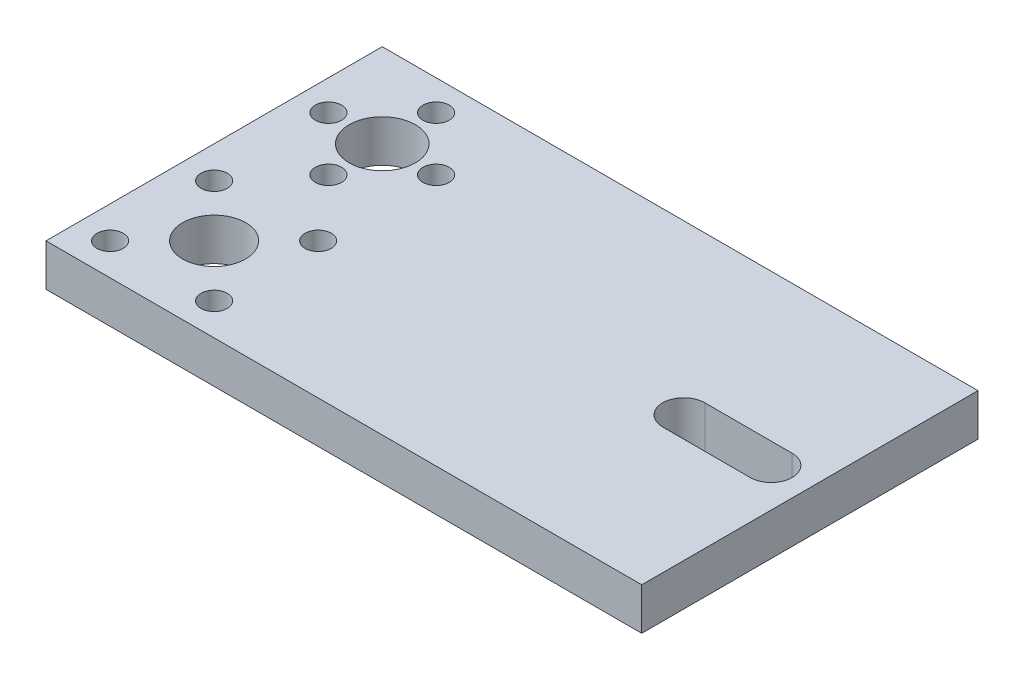
ISO-10303-21;
HEADER;
FILE_DESCRIPTION(('STEP AP214'),'2;1');
FILE_NAME('part.step','',(''),(''),'','','');
FILE_SCHEMA(('AUTOMOTIVE_DESIGN { 1 0 10303 214 1 1 1 1 }'));
ENDSEC;
DATA;
#1=APPLICATION_CONTEXT('core data for automotive mechanical design processes');
#2=APPLICATION_PROTOCOL_DEFINITION('international standard','automotive_design',2000,#1);
#3=PRODUCT_CONTEXT('',#1,'mechanical');
#4=PRODUCT('Part','Part','',(#3));
#5=PRODUCT_RELATED_PRODUCT_CATEGORY('part','',(#4));
#6=PRODUCT_DEFINITION_FORMATION('','',#4);
#7=PRODUCT_DEFINITION_CONTEXT('part definition',#1,'design');
#8=PRODUCT_DEFINITION('design','',#6,#7);
#9=PRODUCT_DEFINITION_SHAPE('','',#8);
#10=(LENGTH_UNIT() NAMED_UNIT(*) SI_UNIT(.MILLI.,.METRE.));
#11=(NAMED_UNIT(*) PLANE_ANGLE_UNIT() SI_UNIT($,.RADIAN.));
#12=(NAMED_UNIT(*) SI_UNIT($,.STERADIAN.) SOLID_ANGLE_UNIT());
#13=UNCERTAINTY_MEASURE_WITH_UNIT(LENGTH_MEASURE(1.E-05),#10,'distance_accuracy_value','');
#14=(GEOMETRIC_REPRESENTATION_CONTEXT(3) GLOBAL_UNCERTAINTY_ASSIGNED_CONTEXT((#13)) GLOBAL_UNIT_ASSIGNED_CONTEXT((#10,
#11,#12)) REPRESENTATION_CONTEXT('',''));
#15=CARTESIAN_POINT('',(0.,0.,0.));
#16=DIRECTION('',(0.,0.,1.));
#17=DIRECTION('',(1.,0.,0.));
#18=AXIS2_PLACEMENT_3D('',#15,#16,#17);
#19=CARTESIAN_POINT('',(0.,6.35,0.));
#20=DIRECTION('',(0.,-1.,0.));
#21=DIRECTION('',(0.,0.,-1.));
#22=AXIS2_PLACEMENT_3D('',#19,#20,#21);
#23=PLANE('',#22);
#24=CARTESIAN_POINT('',(-37.3,6.35,-8.13));
#25=DIRECTION('',(0.,1.,0.));
#26=DIRECTION('',(0.,0.,1.));
#27=AXIS2_PLACEMENT_3D('',#24,#25,#26);
#28=CIRCLE('',#27,1.984375);
#29=CARTESIAN_POINT('',(-37.3,6.35,-6.14562500000001));
#30=VERTEX_POINT('',#29);
#31=EDGE_CURVE('E136',#30,#30,#28,.T.);
#32=ORIENTED_EDGE('',*,*,#31,.F.);
#33=EDGE_LOOP('',(#32));
#34=FACE_BOUND('',#33,.T.);
#35=CARTESIAN_POINT('',(-45.43,6.35,0.));
#36=DIRECTION('',(0.,1.,0.));
#37=DIRECTION('',(0.,0.,1.));
#38=AXIS2_PLACEMENT_3D('',#35,#36,#37);
#39=CIRCLE('',#38,1.984375);
#40=CARTESIAN_POINT('',(-45.43,6.35,1.984375));
#41=VERTEX_POINT('',#40);
#42=EDGE_CURVE('E142',#41,#41,#39,.T.);
#43=ORIENTED_EDGE('',*,*,#42,.F.);
#44=EDGE_LOOP('',(#43));
#45=FACE_BOUND('',#44,.T.);
#46=CARTESIAN_POINT('',(-37.3,6.35,25.4));
#47=DIRECTION('',(0.,1.,0.));
#48=DIRECTION('',(0.,0.,-1.));
#49=AXIS2_PLACEMENT_3D('',#46,#47,#48);
#50=CIRCLE('',#49,4.7625);
#51=CARTESIAN_POINT('',(-37.3,6.35,20.6375));
#52=VERTEX_POINT('',#51);
#53=EDGE_CURVE('E148',#52,#52,#50,.T.);
#54=ORIENTED_EDGE('',*,*,#53,.F.);
#55=EDGE_LOOP('',(#54));
#56=FACE_BOUND('',#55,.T.);
#57=CARTESIAN_POINT('',(-37.3,6.35,8.13));
#58=DIRECTION('',(0.,1.,0.));
#59=DIRECTION('',(0.,0.,1.));
#60=AXIS2_PLACEMENT_3D('',#57,#58,#59);
#61=CIRCLE('',#60,1.984375);
#62=CARTESIAN_POINT('',(-37.3,6.35,10.114375));
#63=VERTEX_POINT('',#62);
#64=EDGE_CURVE('E154',#63,#63,#61,.T.);
#65=ORIENTED_EDGE('',*,*,#64,.F.);
#66=EDGE_LOOP('',(#65));
#67=FACE_BOUND('',#66,.T.);
#68=CARTESIAN_POINT('',(-37.3,6.35,0.));
#69=DIRECTION('',(0.,1.,0.));
#70=DIRECTION('',(0.,0.,1.));
#71=AXIS2_PLACEMENT_3D('',#68,#69,#70);
#72=CIRCLE('',#71,5.);
#73=CARTESIAN_POINT('',(-37.3,6.35,5.));
#74=VERTEX_POINT('',#73);
#75=EDGE_CURVE('E160',#74,#74,#72,.T.);
#76=ORIENTED_EDGE('',*,*,#75,.F.);
#77=EDGE_LOOP('',(#76));
#78=FACE_BOUND('',#77,.T.);
#79=DIRECTION('',(0.,0.,1.));
#80=VECTOR('',#79,1.);
#81=CARTESIAN_POINT('',(-50.,6.35,38.1));
#82=LINE('',#81,#80);
#83=CARTESIAN_POINT('',(-50.,6.35,-12.7));
#84=VERTEX_POINT('',#83);
#85=CARTESIAN_POINT('',(-50.,6.35,38.1));
#86=VERTEX_POINT('',#85);
#87=EDGE_CURVE('E166',#84,#86,#82,.T.);
#88=ORIENTED_EDGE('',*,*,#87,.T.);
#89=DIRECTION('',(1.,0.,0.));
#90=VECTOR('',#89,1.);
#91=CARTESIAN_POINT('',(-50.,6.35,38.1));
#92=LINE('',#91,#90);
#93=CARTESIAN_POINT('',(40.,6.35,38.1));
#94=VERTEX_POINT('',#93);
#95=EDGE_CURVE('E169',#86,#94,#92,.T.);
#96=ORIENTED_EDGE('',*,*,#95,.T.);
#97=DIRECTION('',(0.,0.,-1.));
#98=VECTOR('',#97,1.);
#99=CARTESIAN_POINT('',(40.,6.35,38.1));
#100=LINE('',#99,#98);
#101=CARTESIAN_POINT('',(40.,6.35,-12.7));
#102=VERTEX_POINT('',#101);
#103=EDGE_CURVE('E172',#94,#102,#100,.T.);
#104=ORIENTED_EDGE('',*,*,#103,.T.);
#105=DIRECTION('',(-1.,0.,0.));
#106=VECTOR('',#105,1.);
#107=CARTESIAN_POINT('',(-50.,6.35,-12.7));
#108=LINE('',#107,#106);
#109=EDGE_CURVE('E174',#102,#84,#108,.T.);
#110=ORIENTED_EDGE('',*,*,#109,.T.);
#111=EDGE_LOOP('',(#88,#96,#104,#110));
#112=FACE_BOUND('',#111,.T.);
#113=CARTESIAN_POINT('',(20.945,6.35,12.7));
#114=DIRECTION('',(0.,1.,0.));
#115=DIRECTION('',(0.,0.,1.));
#116=AXIS2_PLACEMENT_3D('',#113,#114,#115);
#117=CIRCLE('',#116,3.175);
#118=CARTESIAN_POINT('',(20.945,6.35,9.525));
#119=VERTEX_POINT('',#118);
#120=CARTESIAN_POINT('',(20.945,6.35,15.875));
#121=VERTEX_POINT('',#120);
#122=EDGE_CURVE('E97',#119,#121,#117,.T.);
#123=ORIENTED_EDGE('',*,*,#122,.F.);
#124=DIRECTION('',(-1.,0.,0.));
#125=VECTOR('',#124,1.);
#126=CARTESIAN_POINT('',(20.945,6.35,9.525));
#127=LINE('',#126,#125);
#128=CARTESIAN_POINT('',(34.155,6.35,9.52499999999999));
#129=VERTEX_POINT('',#128);
#130=EDGE_CURVE('E120',#129,#119,#127,.T.);
#131=ORIENTED_EDGE('',*,*,#130,.F.);
#132=CARTESIAN_POINT('',(34.155,6.35,12.7));
#133=DIRECTION('',(0.,1.,0.));
#134=DIRECTION('',(0.,0.,1.));
#135=AXIS2_PLACEMENT_3D('',#132,#133,#134);
#136=CIRCLE('',#135,3.175);
#137=CARTESIAN_POINT('',(34.155,6.35,15.875));
#138=VERTEX_POINT('',#137);
#139=EDGE_CURVE('E118',#138,#129,#136,.T.);
#140=ORIENTED_EDGE('',*,*,#139,.F.);
#141=DIRECTION('',(1.,0.,0.));
#142=VECTOR('',#141,1.);
#143=CARTESIAN_POINT('',(20.945,6.35,15.875));
#144=LINE('',#143,#142);
#145=EDGE_CURVE('E105',#121,#138,#144,.T.);
#146=ORIENTED_EDGE('',*,*,#145,.F.);
#147=EDGE_LOOP('',(#123,#131,#140,#146));
#148=FACE_BOUND('',#147,.T.);
#149=CARTESIAN_POINT('',(-29.17,6.35,0.));
#150=DIRECTION('',(0.,1.,0.));
#151=DIRECTION('',(0.,0.,1.));
#152=AXIS2_PLACEMENT_3D('',#149,#150,#151);
#153=CIRCLE('',#152,1.984375);
#154=CARTESIAN_POINT('',(-29.17,6.35,1.98437499999999));
#155=VERTEX_POINT('',#154);
#156=EDGE_CURVE('E126',#155,#155,#153,.T.);
#157=ORIENTED_EDGE('',*,*,#156,.F.);
#158=EDGE_LOOP('',(#157));
#159=FACE_BOUND('',#158,.T.);
#160=CARTESIAN_POINT('',(-45.1577241059355,6.35,17.5422758940645));
#161=DIRECTION('',(0.,1.,0.));
#162=DIRECTION('',(0.,0.,1.));
#163=AXIS2_PLACEMENT_3D('',#160,#161,#162);
#164=CIRCLE('',#163,1.98437499999999);
#165=CARTESIAN_POINT('',(-45.1577241059355,6.35,19.5266508940645));
#166=VERTEX_POINT('',#165);
#167=EDGE_CURVE('E317',#166,#166,#164,.T.);
#168=ORIENTED_EDGE('',*,*,#167,.F.);
#169=EDGE_LOOP('',(#168));
#170=FACE_BOUND('',#169,.T.);
#171=CARTESIAN_POINT('',(-29.4422758940645,6.35,17.5422758940644));
#172=DIRECTION('',(0.,1.,0.));
#173=DIRECTION('',(0.,0.,1.));
#174=AXIS2_PLACEMENT_3D('',#171,#172,#173);
#175=CIRCLE('',#174,1.98437499999999);
#176=CARTESIAN_POINT('',(-29.4422758940645,6.35,19.5266508940643));
#177=VERTEX_POINT('',#176);
#178=EDGE_CURVE('E311',#177,#177,#175,.T.);
#179=ORIENTED_EDGE('',*,*,#178,.F.);
#180=EDGE_LOOP('',(#179));
#181=FACE_BOUND('',#180,.T.);
#182=CARTESIAN_POINT('',(-29.4422758940644,6.35,33.2577241059354));
#183=DIRECTION('',(0.,1.,0.));
#184=DIRECTION('',(0.,0.,1.));
#185=AXIS2_PLACEMENT_3D('',#182,#183,#184);
#186=CIRCLE('',#185,1.984375);
#187=CARTESIAN_POINT('',(-29.4422758940644,6.35,35.2420991059354));
#188=VERTEX_POINT('',#187);
#189=EDGE_CURVE('E305',#188,#188,#186,.T.);
#190=ORIENTED_EDGE('',*,*,#189,.F.);
#191=EDGE_LOOP('',(#190));
#192=FACE_BOUND('',#191,.T.);
#193=CARTESIAN_POINT('',(-45.1577241059354,6.35,33.2577241059355));
#194=DIRECTION('',(0.,1.,0.));
#195=DIRECTION('',(0.,0.,1.));
#196=AXIS2_PLACEMENT_3D('',#193,#194,#195);
#197=CIRCLE('',#196,1.98437499999999);
#198=CARTESIAN_POINT('',(-45.1577241059354,6.35,35.2420991059355));
#199=VERTEX_POINT('',#198);
#200=EDGE_CURVE('E296',#199,#199,#197,.T.);
#201=ORIENTED_EDGE('',*,*,#200,.F.);
#202=EDGE_LOOP('',(#201));
#203=FACE_BOUND('',#202,.T.);
#204=ADVANCED_FACE('F32',(#34,#45,#56,#67,#78,#112,#148,#159,#170,#181,#192,#203),#23,.F.);
#205=CARTESIAN_POINT('',(0.,0.,0.));
#206=DIRECTION('',(0.,-1.,0.));
#207=DIRECTION('',(0.,0.,-1.));
#208=AXIS2_PLACEMENT_3D('',#205,#206,#207);
#209=PLANE('',#208);
#210=CARTESIAN_POINT('',(-29.4422758940644,0.,33.2577241059354));
#211=DIRECTION('',(0.,1.,0.));
#212=DIRECTION('',(0.,0.,1.));
#213=AXIS2_PLACEMENT_3D('',#210,#211,#212);
#214=CIRCLE('',#213,1.984375);
#215=CARTESIAN_POINT('',(-29.4422758940644,0.,35.2420991059354));
#216=VERTEX_POINT('',#215);
#217=EDGE_CURVE('E302',#216,#216,#214,.T.);
#218=ORIENTED_EDGE('',*,*,#217,.T.);
#219=EDGE_LOOP('',(#218));
#220=FACE_BOUND('',#219,.T.);
#221=CARTESIAN_POINT('',(-45.1577241059355,0.,17.5422758940645));
#222=DIRECTION('',(0.,1.,0.));
#223=DIRECTION('',(0.,0.,1.));
#224=AXIS2_PLACEMENT_3D('',#221,#222,#223);
#225=CIRCLE('',#224,1.98437499999999);
#226=CARTESIAN_POINT('',(-45.1577241059355,0.,19.5266508940645));
#227=VERTEX_POINT('',#226);
#228=EDGE_CURVE('E314',#227,#227,#225,.T.);
#229=ORIENTED_EDGE('',*,*,#228,.T.);
#230=EDGE_LOOP('',(#229));
#231=FACE_BOUND('',#230,.T.);
#232=DIRECTION('',(-1.,0.,0.));
#233=VECTOR('',#232,1.);
#234=CARTESIAN_POINT('',(20.945,0.,9.525));
#235=LINE('',#234,#233);
#236=CARTESIAN_POINT('',(34.155,0.,9.52499999999999));
#237=VERTEX_POINT('',#236);
#238=CARTESIAN_POINT('',(20.945,0.,9.525));
#239=VERTEX_POINT('',#238);
#240=EDGE_CURVE('E106',#237,#239,#235,.T.);
#241=ORIENTED_EDGE('',*,*,#240,.T.);
#242=CARTESIAN_POINT('',(20.945,0.,12.7));
#243=DIRECTION('',(0.,1.,0.));
#244=DIRECTION('',(0.,0.,1.));
#245=AXIS2_PLACEMENT_3D('',#242,#243,#244);
#246=CIRCLE('',#245,3.175);
#247=CARTESIAN_POINT('',(20.945,0.,15.875));
#248=VERTEX_POINT('',#247);
#249=EDGE_CURVE('E55',#239,#248,#246,.T.);
#250=ORIENTED_EDGE('',*,*,#249,.T.);
#251=DIRECTION('',(1.,0.,0.));
#252=VECTOR('',#251,1.);
#253=CARTESIAN_POINT('',(20.945,0.,15.875));
#254=LINE('',#253,#252);
#255=CARTESIAN_POINT('',(34.155,0.,15.875));
#256=VERTEX_POINT('',#255);
#257=EDGE_CURVE('E112',#248,#256,#254,.T.);
#258=ORIENTED_EDGE('',*,*,#257,.T.);
#259=CARTESIAN_POINT('',(34.155,0.,12.7));
#260=DIRECTION('',(0.,1.,0.));
#261=DIRECTION('',(0.,0.,1.));
#262=AXIS2_PLACEMENT_3D('',#259,#260,#261);
#263=CIRCLE('',#262,3.175);
#264=EDGE_CURVE('E128',#256,#237,#263,.T.);
#265=ORIENTED_EDGE('',*,*,#264,.T.);
#266=EDGE_LOOP('',(#241,#250,#258,#265));
#267=FACE_BOUND('',#266,.T.);
#268=CARTESIAN_POINT('',(-37.3,0.,-8.13));
#269=DIRECTION('',(0.,1.,0.));
#270=DIRECTION('',(0.,0.,1.));
#271=AXIS2_PLACEMENT_3D('',#268,#269,#270);
#272=CIRCLE('',#271,1.984375);
#273=CARTESIAN_POINT('',(-37.3,0.,-6.14562500000001));
#274=VERTEX_POINT('',#273);
#275=EDGE_CURVE('E113',#274,#274,#272,.T.);
#276=ORIENTED_EDGE('',*,*,#275,.T.);
#277=EDGE_LOOP('',(#276));
#278=FACE_BOUND('',#277,.T.);
#279=CARTESIAN_POINT('',(-37.3,0.,25.4));
#280=DIRECTION('',(0.,1.,0.));
#281=DIRECTION('',(0.,0.,-1.));
#282=AXIS2_PLACEMENT_3D('',#279,#280,#281);
#283=CIRCLE('',#282,4.7625);
#284=CARTESIAN_POINT('',(-37.3,0.,20.6375));
#285=VERTEX_POINT('',#284);
#286=EDGE_CURVE('E145',#285,#285,#283,.T.);
#287=ORIENTED_EDGE('',*,*,#286,.T.);
#288=EDGE_LOOP('',(#287));
#289=FACE_BOUND('',#288,.T.);
#290=CARTESIAN_POINT('',(-37.3,0.,0.));
#291=DIRECTION('',(0.,1.,0.));
#292=DIRECTION('',(0.,0.,1.));
#293=AXIS2_PLACEMENT_3D('',#290,#291,#292);
#294=CIRCLE('',#293,5.);
#295=CARTESIAN_POINT('',(-37.3,0.,5.));
#296=VERTEX_POINT('',#295);
#297=EDGE_CURVE('E157',#296,#296,#294,.T.);
#298=ORIENTED_EDGE('',*,*,#297,.T.);
#299=EDGE_LOOP('',(#298));
#300=FACE_BOUND('',#299,.T.);
#301=DIRECTION('',(0.,0.,1.));
#302=VECTOR('',#301,1.);
#303=CARTESIAN_POINT('',(-50.,0.,38.1));
#304=LINE('',#303,#302);
#305=CARTESIAN_POINT('',(-50.,0.,-12.7));
#306=VERTEX_POINT('',#305);
#307=CARTESIAN_POINT('',(-50.,0.,38.1));
#308=VERTEX_POINT('',#307);
#309=EDGE_CURVE('E163',#306,#308,#304,.T.);
#310=ORIENTED_EDGE('',*,*,#309,.F.);
#311=DIRECTION('',(-1.,0.,0.));
#312=VECTOR('',#311,1.);
#313=CARTESIAN_POINT('',(-50.,0.,-12.7));
#314=LINE('',#313,#312);
#315=CARTESIAN_POINT('',(40.,0.,-12.7));
#316=VERTEX_POINT('',#315);
#317=EDGE_CURVE('E170',#316,#306,#314,.T.);
#318=ORIENTED_EDGE('',*,*,#317,.F.);
#319=DIRECTION('',(0.,0.,-1.));
#320=VECTOR('',#319,1.);
#321=CARTESIAN_POINT('',(40.,0.,38.1));
#322=LINE('',#321,#320);
#323=CARTESIAN_POINT('',(40.,0.,38.1));
#324=VERTEX_POINT('',#323);
#325=EDGE_CURVE('E181',#324,#316,#322,.T.);
#326=ORIENTED_EDGE('',*,*,#325,.F.);
#327=DIRECTION('',(1.,0.,0.));
#328=VECTOR('',#327,1.);
#329=CARTESIAN_POINT('',(-50.,0.,38.1));
#330=LINE('',#329,#328);
#331=EDGE_CURVE('E179',#308,#324,#330,.T.);
#332=ORIENTED_EDGE('',*,*,#331,.F.);
#333=EDGE_LOOP('',(#310,#318,#326,#332));
#334=FACE_BOUND('',#333,.T.);
#335=CARTESIAN_POINT('',(-37.3,0.,8.13));
#336=DIRECTION('',(0.,1.,0.));
#337=DIRECTION('',(0.,0.,1.));
#338=AXIS2_PLACEMENT_3D('',#335,#336,#337);
#339=CIRCLE('',#338,1.984375);
#340=CARTESIAN_POINT('',(-37.3,0.,10.114375));
#341=VERTEX_POINT('',#340);
#342=EDGE_CURVE('E151',#341,#341,#339,.T.);
#343=ORIENTED_EDGE('',*,*,#342,.T.);
#344=EDGE_LOOP('',(#343));
#345=FACE_BOUND('',#344,.T.);
#346=CARTESIAN_POINT('',(-45.43,0.,0.));
#347=DIRECTION('',(0.,1.,0.));
#348=DIRECTION('',(0.,0.,1.));
#349=AXIS2_PLACEMENT_3D('',#346,#347,#348);
#350=CIRCLE('',#349,1.984375);
#351=CARTESIAN_POINT('',(-45.43,0.,1.984375));
#352=VERTEX_POINT('',#351);
#353=EDGE_CURVE('E139',#352,#352,#350,.T.);
#354=ORIENTED_EDGE('',*,*,#353,.T.);
#355=EDGE_LOOP('',(#354));
#356=FACE_BOUND('',#355,.T.);
#357=CARTESIAN_POINT('',(-29.17,0.,0.));
#358=DIRECTION('',(0.,1.,0.));
#359=DIRECTION('',(0.,0.,1.));
#360=AXIS2_PLACEMENT_3D('',#357,#358,#359);
#361=CIRCLE('',#360,1.984375);
#362=CARTESIAN_POINT('',(-29.17,0.,1.98437499999999));
#363=VERTEX_POINT('',#362);
#364=EDGE_CURVE('E320',#363,#363,#361,.T.);
#365=ORIENTED_EDGE('',*,*,#364,.T.);
#366=EDGE_LOOP('',(#365));
#367=FACE_BOUND('',#366,.T.);
#368=CARTESIAN_POINT('',(-29.4422758940645,0.,17.5422758940644));
#369=DIRECTION('',(0.,1.,0.));
#370=DIRECTION('',(0.,0.,1.));
#371=AXIS2_PLACEMENT_3D('',#368,#369,#370);
#372=CIRCLE('',#371,1.98437499999999);
#373=CARTESIAN_POINT('',(-29.4422758940645,0.,19.5266508940643));
#374=VERTEX_POINT('',#373);
#375=EDGE_CURVE('E308',#374,#374,#372,.T.);
#376=ORIENTED_EDGE('',*,*,#375,.T.);
#377=EDGE_LOOP('',(#376));
#378=FACE_BOUND('',#377,.T.);
#379=CARTESIAN_POINT('',(-45.1577241059354,0.,33.2577241059355));
#380=DIRECTION('',(0.,1.,0.));
#381=DIRECTION('',(0.,0.,1.));
#382=AXIS2_PLACEMENT_3D('',#379,#380,#381);
#383=CIRCLE('',#382,1.98437499999999);
#384=CARTESIAN_POINT('',(-45.1577241059354,0.,35.2420991059355));
#385=VERTEX_POINT('',#384);
#386=EDGE_CURVE('E299',#385,#385,#383,.T.);
#387=ORIENTED_EDGE('',*,*,#386,.T.);
#388=EDGE_LOOP('',(#387));
#389=FACE_BOUND('',#388,.T.);
#390=ADVANCED_FACE('F199',(#220,#231,#267,#278,#289,#300,#334,#345,#356,#367,#378,#389),#209,.T.);
#391=CARTESIAN_POINT('',(-50.,6.35,38.1));
#392=DIRECTION('',(1.,0.,0.));
#393=DIRECTION('',(0.,0.,-1.));
#394=AXIS2_PLACEMENT_3D('',#391,#392,#393);
#395=PLANE('',#394);
#396=ORIENTED_EDGE('',*,*,#309,.T.);
#397=DIRECTION('',(0.,-1.,0.));
#398=VECTOR('',#397,1.);
#399=CARTESIAN_POINT('',(-50.,6.35,38.1));
#400=LINE('',#399,#398);
#401=EDGE_CURVE('E11',#86,#308,#400,.T.);
#402=ORIENTED_EDGE('',*,*,#401,.F.);
#403=ORIENTED_EDGE('',*,*,#87,.F.);
#404=DIRECTION('',(0.,-1.,0.));
#405=VECTOR('',#404,1.);
#406=CARTESIAN_POINT('',(-50.,6.35,-12.7));
#407=LINE('',#406,#405);
#408=EDGE_CURVE('E176',#84,#306,#407,.T.);
#409=ORIENTED_EDGE('',*,*,#408,.T.);
#410=EDGE_LOOP('',(#396,#402,#403,#409));
#411=FACE_BOUND('',#410,.T.);
#412=ADVANCED_FACE('F34',(#411),#395,.F.);
#413=CARTESIAN_POINT('',(-50.,6.35,38.1));
#414=DIRECTION('',(0.,0.,-1.));
#415=DIRECTION('',(-1.,0.,0.));
#416=AXIS2_PLACEMENT_3D('',#413,#414,#415);
#417=PLANE('',#416);
#418=ORIENTED_EDGE('',*,*,#331,.T.);
#419=DIRECTION('',(0.,-1.,0.));
#420=VECTOR('',#419,1.);
#421=CARTESIAN_POINT('',(40.,6.35,38.1));
#422=LINE('',#421,#420);
#423=EDGE_CURVE('E40',#94,#324,#422,.T.);
#424=ORIENTED_EDGE('',*,*,#423,.F.);
#425=ORIENTED_EDGE('',*,*,#95,.F.);
#426=ORIENTED_EDGE('',*,*,#401,.T.);
#427=EDGE_LOOP('',(#418,#424,#425,#426));
#428=FACE_BOUND('',#427,.T.);
#429=ADVANCED_FACE('F209',(#428),#417,.F.);
#430=CARTESIAN_POINT('',(40.,6.35,38.1));
#431=DIRECTION('',(-1.,0.,0.));
#432=DIRECTION('',(0.,0.,1.));
#433=AXIS2_PLACEMENT_3D('',#430,#431,#432);
#434=PLANE('',#433);
#435=ORIENTED_EDGE('',*,*,#325,.T.);
#436=DIRECTION('',(0.,-1.,0.));
#437=VECTOR('',#436,1.);
#438=CARTESIAN_POINT('',(40.,6.35,-12.7));
#439=LINE('',#438,#437);
#440=EDGE_CURVE('E186',#102,#316,#439,.T.);
#441=ORIENTED_EDGE('',*,*,#440,.F.);
#442=ORIENTED_EDGE('',*,*,#103,.F.);
#443=ORIENTED_EDGE('',*,*,#423,.T.);
#444=EDGE_LOOP('',(#435,#441,#442,#443));
#445=FACE_BOUND('',#444,.T.);
#446=ADVANCED_FACE('F193',(#445),#434,.F.);
#447=CARTESIAN_POINT('',(-50.,6.35,-12.7));
#448=DIRECTION('',(0.,0.,1.));
#449=DIRECTION('',(1.,0.,0.));
#450=AXIS2_PLACEMENT_3D('',#447,#448,#449);
#451=PLANE('',#450);
#452=ORIENTED_EDGE('',*,*,#317,.T.);
#453=ORIENTED_EDGE('',*,*,#408,.F.);
#454=ORIENTED_EDGE('',*,*,#109,.F.);
#455=ORIENTED_EDGE('',*,*,#440,.T.);
#456=EDGE_LOOP('',(#452,#453,#454,#455));
#457=FACE_BOUND('',#456,.T.);
#458=ADVANCED_FACE('F203',(#457),#451,.F.);
#459=CARTESIAN_POINT('',(-37.3,6.35,0.));
#460=DIRECTION('',(0.,-1.,0.));
#461=DIRECTION('',(0.,0.,-1.));
#462=AXIS2_PLACEMENT_3D('',#459,#460,#461);
#463=CYLINDRICAL_SURFACE('',#462,5.);
#464=ORIENTED_EDGE('',*,*,#75,.T.);
#465=EDGE_LOOP('',(#464));
#466=FACE_BOUND('',#465,.T.);
#467=ORIENTED_EDGE('',*,*,#297,.F.);
#468=EDGE_LOOP('',(#467));
#469=FACE_BOUND('',#468,.T.);
#470=ADVANCED_FACE('F227',(#466,#469),#463,.F.);
#471=CARTESIAN_POINT('',(-37.3,6.35,8.13));
#472=DIRECTION('',(0.,-1.,0.));
#473=DIRECTION('',(0.,0.,-1.));
#474=AXIS2_PLACEMENT_3D('',#471,#472,#473);
#475=CYLINDRICAL_SURFACE('',#474,1.984375);
#476=ORIENTED_EDGE('',*,*,#64,.T.);
#477=EDGE_LOOP('',(#476));
#478=FACE_BOUND('',#477,.T.);
#479=ORIENTED_EDGE('',*,*,#342,.F.);
#480=EDGE_LOOP('',(#479));
#481=FACE_BOUND('',#480,.T.);
#482=ADVANCED_FACE('F234',(#478,#481),#475,.F.);
#483=CARTESIAN_POINT('',(-37.3,6.35,25.4));
#484=DIRECTION('',(0.,-1.,0.));
#485=DIRECTION('',(0.,0.,-1.));
#486=AXIS2_PLACEMENT_3D('',#483,#484,#485);
#487=CYLINDRICAL_SURFACE('',#486,4.7625);
#488=ORIENTED_EDGE('',*,*,#53,.T.);
#489=EDGE_LOOP('',(#488));
#490=FACE_BOUND('',#489,.T.);
#491=ORIENTED_EDGE('',*,*,#286,.F.);
#492=EDGE_LOOP('',(#491));
#493=FACE_BOUND('',#492,.T.);
#494=ADVANCED_FACE('F239',(#490,#493),#487,.F.);
#495=CARTESIAN_POINT('',(-45.43,6.35,0.));
#496=DIRECTION('',(0.,-1.,0.));
#497=DIRECTION('',(0.,0.,-1.));
#498=AXIS2_PLACEMENT_3D('',#495,#496,#497);
#499=CYLINDRICAL_SURFACE('',#498,1.984375);
#500=ORIENTED_EDGE('',*,*,#42,.T.);
#501=EDGE_LOOP('',(#500));
#502=FACE_BOUND('',#501,.T.);
#503=ORIENTED_EDGE('',*,*,#353,.F.);
#504=EDGE_LOOP('',(#503));
#505=FACE_BOUND('',#504,.T.);
#506=ADVANCED_FACE('F249',(#502,#505),#499,.F.);
#507=CARTESIAN_POINT('',(-37.3,6.35,-8.13));
#508=DIRECTION('',(0.,-1.,0.));
#509=DIRECTION('',(0.,0.,-1.));
#510=AXIS2_PLACEMENT_3D('',#507,#508,#509);
#511=CYLINDRICAL_SURFACE('',#510,1.984375);
#512=ORIENTED_EDGE('',*,*,#31,.T.);
#513=EDGE_LOOP('',(#512));
#514=FACE_BOUND('',#513,.T.);
#515=ORIENTED_EDGE('',*,*,#275,.F.);
#516=EDGE_LOOP('',(#515));
#517=FACE_BOUND('',#516,.T.);
#518=ADVANCED_FACE('F256',(#514,#517),#511,.F.);
#519=CARTESIAN_POINT('',(20.945,6.35,12.7));
#520=DIRECTION('',(0.,-1.,0.));
#521=DIRECTION('',(0.,0.,-1.));
#522=AXIS2_PLACEMENT_3D('',#519,#520,#521);
#523=CYLINDRICAL_SURFACE('',#522,3.175);
#524=ORIENTED_EDGE('',*,*,#249,.F.);
#525=DIRECTION('',(0.,-1.,0.));
#526=VECTOR('',#525,1.);
#527=CARTESIAN_POINT('',(20.945,6.35,9.525));
#528=LINE('',#527,#526);
#529=EDGE_CURVE('E101',#119,#239,#528,.T.);
#530=ORIENTED_EDGE('',*,*,#529,.F.);
#531=ORIENTED_EDGE('',*,*,#122,.T.);
#532=DIRECTION('',(0.,-1.,0.));
#533=VECTOR('',#532,1.);
#534=CARTESIAN_POINT('',(20.945,6.35,15.875));
#535=LINE('',#534,#533);
#536=EDGE_CURVE('E100',#121,#248,#535,.T.);
#537=ORIENTED_EDGE('',*,*,#536,.T.);
#538=EDGE_LOOP('',(#524,#530,#531,#537));
#539=FACE_BOUND('',#538,.T.);
#540=ADVANCED_FACE('F99',(#539),#523,.F.);
#541=CARTESIAN_POINT('',(20.945,6.35,15.875));
#542=DIRECTION('',(0.,0.,-1.));
#543=DIRECTION('',(-1.,0.,0.));
#544=AXIS2_PLACEMENT_3D('',#541,#542,#543);
#545=PLANE('',#544);
#546=ORIENTED_EDGE('',*,*,#257,.F.);
#547=ORIENTED_EDGE('',*,*,#536,.F.);
#548=ORIENTED_EDGE('',*,*,#145,.T.);
#549=DIRECTION('',(0.,-1.,0.));
#550=VECTOR('',#549,1.);
#551=CARTESIAN_POINT('',(34.155,6.35,15.875));
#552=LINE('',#551,#550);
#553=EDGE_CURVE('E114',#138,#256,#552,.T.);
#554=ORIENTED_EDGE('',*,*,#553,.T.);
#555=EDGE_LOOP('',(#546,#547,#548,#554));
#556=FACE_BOUND('',#555,.T.);
#557=ADVANCED_FACE('F109',(#556),#545,.T.);
#558=CARTESIAN_POINT('',(34.155,6.35,12.7));
#559=DIRECTION('',(0.,-1.,0.));
#560=DIRECTION('',(0.,0.,-1.));
#561=AXIS2_PLACEMENT_3D('',#558,#559,#560);
#562=CYLINDRICAL_SURFACE('',#561,3.175);
#563=ORIENTED_EDGE('',*,*,#264,.F.);
#564=ORIENTED_EDGE('',*,*,#553,.F.);
#565=ORIENTED_EDGE('',*,*,#139,.T.);
#566=DIRECTION('',(0.,-1.,0.));
#567=VECTOR('',#566,1.);
#568=CARTESIAN_POINT('',(34.155,6.35,9.52499999999999));
#569=LINE('',#568,#567);
#570=EDGE_CURVE('E47',#129,#237,#569,.T.);
#571=ORIENTED_EDGE('',*,*,#570,.T.);
#572=EDGE_LOOP('',(#563,#564,#565,#571));
#573=FACE_BOUND('',#572,.T.);
#574=ADVANCED_FACE('F265',(#573),#562,.F.);
#575=CARTESIAN_POINT('',(20.945,6.35,9.525));
#576=DIRECTION('',(0.,0.,1.));
#577=DIRECTION('',(1.,0.,0.));
#578=AXIS2_PLACEMENT_3D('',#575,#576,#577);
#579=PLANE('',#578);
#580=ORIENTED_EDGE('',*,*,#240,.F.);
#581=ORIENTED_EDGE('',*,*,#570,.F.);
#582=ORIENTED_EDGE('',*,*,#130,.T.);
#583=ORIENTED_EDGE('',*,*,#529,.T.);
#584=EDGE_LOOP('',(#580,#581,#582,#583));
#585=FACE_BOUND('',#584,.T.);
#586=ADVANCED_FACE('F268',(#585),#579,.T.);
#587=CARTESIAN_POINT('',(-29.17,6.35,0.));
#588=DIRECTION('',(0.,-1.,0.));
#589=DIRECTION('',(0.,0.,-1.));
#590=AXIS2_PLACEMENT_3D('',#587,#588,#589);
#591=CYLINDRICAL_SURFACE('',#590,1.984375);
#592=ORIENTED_EDGE('',*,*,#156,.T.);
#593=EDGE_LOOP('',(#592));
#594=FACE_BOUND('',#593,.T.);
#595=ORIENTED_EDGE('',*,*,#364,.F.);
#596=EDGE_LOOP('',(#595));
#597=FACE_BOUND('',#596,.T.);
#598=ADVANCED_FACE('F272',(#594,#597),#591,.F.);
#599=CARTESIAN_POINT('',(-45.1577241059355,6.35,17.5422758940645));
#600=DIRECTION('',(0.,-1.,0.));
#601=DIRECTION('',(0.,0.,-1.));
#602=AXIS2_PLACEMENT_3D('',#599,#600,#601);
#603=CYLINDRICAL_SURFACE('',#602,1.98437499999999);
#604=ORIENTED_EDGE('',*,*,#167,.T.);
#605=EDGE_LOOP('',(#604));
#606=FACE_BOUND('',#605,.T.);
#607=ORIENTED_EDGE('',*,*,#228,.F.);
#608=EDGE_LOOP('',(#607));
#609=FACE_BOUND('',#608,.T.);
#610=ADVANCED_FACE('F275',(#606,#609),#603,.F.);
#611=CARTESIAN_POINT('',(-29.4422758940645,6.35,17.5422758940644));
#612=DIRECTION('',(0.,-1.,0.));
#613=DIRECTION('',(0.,0.,-1.));
#614=AXIS2_PLACEMENT_3D('',#611,#612,#613);
#615=CYLINDRICAL_SURFACE('',#614,1.98437499999999);
#616=ORIENTED_EDGE('',*,*,#178,.T.);
#617=EDGE_LOOP('',(#616));
#618=FACE_BOUND('',#617,.T.);
#619=ORIENTED_EDGE('',*,*,#375,.F.);
#620=EDGE_LOOP('',(#619));
#621=FACE_BOUND('',#620,.T.);
#622=ADVANCED_FACE('F279',(#618,#621),#615,.F.);
#623=CARTESIAN_POINT('',(-29.4422758940644,6.35,33.2577241059354));
#624=DIRECTION('',(0.,-1.,0.));
#625=DIRECTION('',(0.,0.,-1.));
#626=AXIS2_PLACEMENT_3D('',#623,#624,#625);
#627=CYLINDRICAL_SURFACE('',#626,1.984375);
#628=ORIENTED_EDGE('',*,*,#189,.T.);
#629=EDGE_LOOP('',(#628));
#630=FACE_BOUND('',#629,.T.);
#631=ORIENTED_EDGE('',*,*,#217,.F.);
#632=EDGE_LOOP('',(#631));
#633=FACE_BOUND('',#632,.T.);
#634=ADVANCED_FACE('F283',(#630,#633),#627,.F.);
#635=CARTESIAN_POINT('',(-45.1577241059354,6.35,33.2577241059355));
#636=DIRECTION('',(0.,-1.,0.));
#637=DIRECTION('',(0.,0.,-1.));
#638=AXIS2_PLACEMENT_3D('',#635,#636,#637);
#639=CYLINDRICAL_SURFACE('',#638,1.98437499999999);
#640=ORIENTED_EDGE('',*,*,#200,.T.);
#641=EDGE_LOOP('',(#640));
#642=FACE_BOUND('',#641,.T.);
#643=ORIENTED_EDGE('',*,*,#386,.F.);
#644=EDGE_LOOP('',(#643));
#645=FACE_BOUND('',#644,.T.);
#646=ADVANCED_FACE('F287',(#642,#645),#639,.F.);
#647=CLOSED_SHELL('',(#204,#390,#412,#429,#446,#458,#470,#482,#494,#506,#518,#540,#557,#574,
#586,#598,#610,#622,#634,#646));
#648=MANIFOLD_SOLID_BREP('B2',#647);
#649=ADVANCED_BREP_SHAPE_REPRESENTATION('',(#18,#648),#14);
#650=SHAPE_DEFINITION_REPRESENTATION(#9,#649);
ENDSEC;
END-ISO-10303-21;
